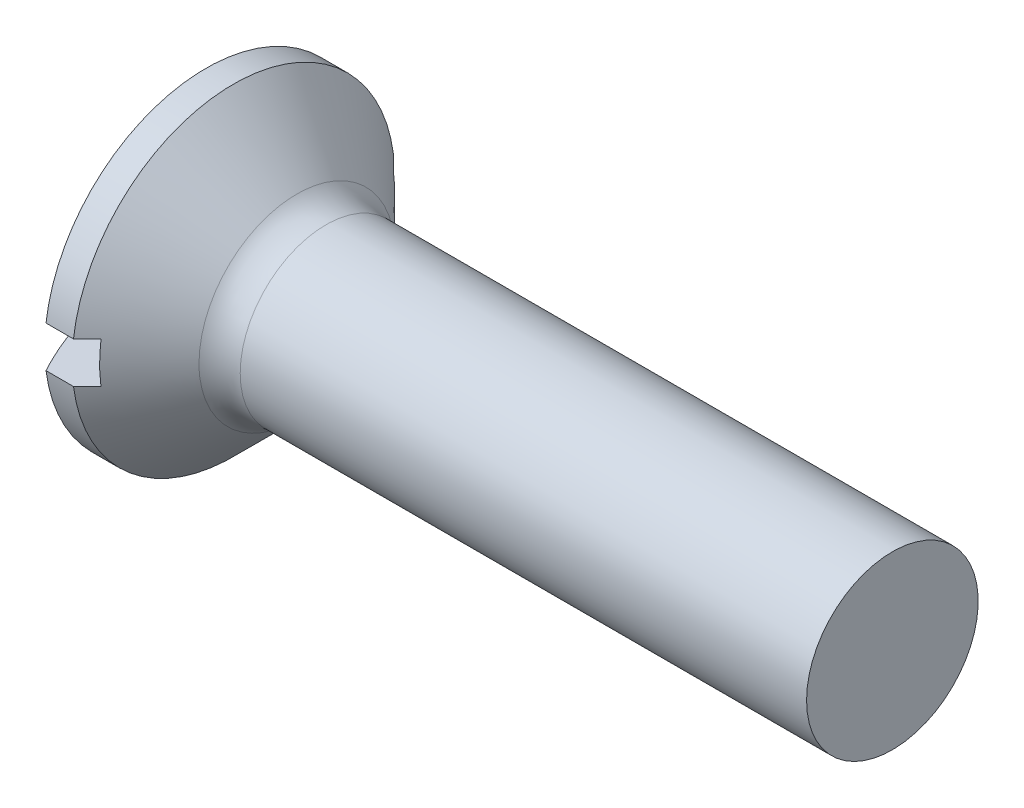
ISO-10303-21;
HEADER;
FILE_DESCRIPTION(('STEP AP214'),'2;1');
FILE_NAME('part.step','',(''),(''),'','','');
FILE_SCHEMA(('AUTOMOTIVE_DESIGN { 1 0 10303 214 1 1 1 1 }'));
ENDSEC;
DATA;
#1=APPLICATION_CONTEXT('core data for automotive mechanical design processes');
#2=APPLICATION_PROTOCOL_DEFINITION('international standard','automotive_design',2000,#1);
#3=PRODUCT_CONTEXT('',#1,'mechanical');
#4=PRODUCT('Part','Part','',(#3));
#5=PRODUCT_RELATED_PRODUCT_CATEGORY('part','',(#4));
#6=PRODUCT_DEFINITION_FORMATION('','',#4);
#7=PRODUCT_DEFINITION_CONTEXT('part definition',#1,'design');
#8=PRODUCT_DEFINITION('design','',#6,#7);
#9=PRODUCT_DEFINITION_SHAPE('','',#8);
#10=(LENGTH_UNIT() NAMED_UNIT(*) SI_UNIT(.MILLI.,.METRE.));
#11=(NAMED_UNIT(*) PLANE_ANGLE_UNIT() SI_UNIT($,.RADIAN.));
#12=(NAMED_UNIT(*) SI_UNIT($,.STERADIAN.) SOLID_ANGLE_UNIT());
#13=UNCERTAINTY_MEASURE_WITH_UNIT(LENGTH_MEASURE(1.E-05),#10,'distance_accuracy_value','');
#14=(GEOMETRIC_REPRESENTATION_CONTEXT(3) GLOBAL_UNCERTAINTY_ASSIGNED_CONTEXT((#13)) GLOBAL_UNIT_ASSIGNED_CONTEXT((#10,
#11,#12)) REPRESENTATION_CONTEXT('',''));
#15=CARTESIAN_POINT('',(0.,0.,0.));
#16=DIRECTION('',(0.,0.,1.));
#17=DIRECTION('',(1.,0.,0.));
#18=AXIS2_PLACEMENT_3D('',#15,#16,#17);
#19=CARTESIAN_POINT('',(4.90208333333334,0.,0.));
#20=DIRECTION('',(-1.,0.,0.));
#21=DIRECTION('',(0.,-1.,0.));
#22=AXIS2_PLACEMENT_3D('',#19,#20,#21);
#23=SPHERICAL_SURFACE('',#22,4.90208333333334);
#24=CARTESIAN_POINT('',(4.90208333333334,0.3,0.));
#25=DIRECTION('',(0.,1.,0.));
#26=DIRECTION('',(0.,0.,1.));
#27=AXIS2_PLACEMENT_3D('',#24,#25,#26);
#28=CIRCLE('',#27,4.89289495155419);
#29=CARTESIAN_POINT('',(0.6,0.3,2.33077240416133));
#30=VERTEX_POINT('',#29);
#31=CARTESIAN_POINT('',(0.6,0.3,-2.33077240416133));
#32=VERTEX_POINT('',#31);
#33=EDGE_CURVE('E184',#30,#32,#28,.F.);
#34=ORIENTED_EDGE('',*,*,#33,.F.);
#35=CARTESIAN_POINT('',(0.6,0.,0.));
#36=DIRECTION('',(-1.,0.,0.));
#37=DIRECTION('',(0.,0.,1.));
#38=AXIS2_PLACEMENT_3D('',#35,#36,#37);
#39=CIRCLE('',#38,2.35);
#40=EDGE_CURVE('E118',#30,#32,#39,.T.);
#41=ORIENTED_EDGE('',*,*,#40,.T.);
#42=EDGE_LOOP('',(#34,#41));
#43=FACE_BOUND('',#42,.T.);
#44=ADVANCED_FACE('F38',(#43),#23,.T.);
#45=CARTESIAN_POINT('',(-15.875,0.,0.));
#46=DIRECTION('',(-1.,0.,0.));
#47=DIRECTION('',(0.,0.,1.));
#48=AXIS2_PLACEMENT_3D('',#45,#46,#47);
#49=CYLINDRICAL_SURFACE('',#48,2.35);
#50=CARTESIAN_POINT('',(1.,0.,0.));
#51=DIRECTION('',(-1.,0.,0.));
#52=DIRECTION('',(0.,0.,1.));
#53=AXIS2_PLACEMENT_3D('',#50,#51,#52);
#54=CIRCLE('',#53,2.35);
#55=CARTESIAN_POINT('',(1.,0.3,2.33077240416133));
#56=VERTEX_POINT('',#55);
#57=CARTESIAN_POINT('',(1.,0.3,-2.33077240416133));
#58=VERTEX_POINT('',#57);
#59=EDGE_CURVE('E112',#56,#58,#54,.T.);
#60=ORIENTED_EDGE('',*,*,#59,.T.);
#61=DIRECTION('',(-1.,0.,0.));
#62=VECTOR('',#61,1.);
#63=CARTESIAN_POINT('',(-15.875,0.3,-2.33077240416133));
#64=LINE('',#63,#62);
#65=EDGE_CURVE('E66',#58,#32,#64,.T.);
#66=ORIENTED_EDGE('',*,*,#65,.T.);
#67=ORIENTED_EDGE('',*,*,#40,.F.);
#68=DIRECTION('',(-1.,0.,0.));
#69=VECTOR('',#68,1.);
#70=CARTESIAN_POINT('',(-15.875,0.3,2.33077240416133));
#71=LINE('',#70,#69);
#72=EDGE_CURVE('E182',#30,#56,#71,.F.);
#73=ORIENTED_EDGE('',*,*,#72,.T.);
#74=EDGE_LOOP('',(#60,#66,#67,#73));
#75=FACE_BOUND('',#74,.T.);
#76=ADVANCED_FACE('F156',(#75),#49,.T.);
#77=CARTESIAN_POINT('',(10.6,0.,0.));
#78=DIRECTION('',(-1.,0.,0.));
#79=DIRECTION('',(0.,0.,1.));
#80=AXIS2_PLACEMENT_3D('',#77,#78,#79);
#81=PLANE('',#80);
#82=CARTESIAN_POINT('',(10.6,0.,0.));
#83=DIRECTION('',(-1.,0.,0.));
#84=DIRECTION('',(0.,0.,1.));
#85=AXIS2_PLACEMENT_3D('',#82,#83,#84);
#86=CIRCLE('',#85,1.25);
#87=CARTESIAN_POINT('',(10.6,0.,1.25));
#88=VERTEX_POINT('',#87);
#89=EDGE_CURVE('E121',#88,#88,#86,.T.);
#90=ORIENTED_EDGE('',*,*,#89,.F.);
#91=EDGE_LOOP('',(#90));
#92=FACE_BOUND('',#91,.T.);
#93=ADVANCED_FACE('F163',(#92),#81,.F.);
#94=CARTESIAN_POINT('',(4.90208333333334,-0.3,0.));
#95=DIRECTION('',(0.,-1.,0.));
#96=DIRECTION('',(0.,0.,-1.));
#97=AXIS2_PLACEMENT_3D('',#94,#95,#96);
#98=CIRCLE('',#97,4.89289495155419);
#99=CARTESIAN_POINT('',(0.6,-0.299999999999999,-2.33077240416133));
#100=VERTEX_POINT('',#99);
#101=CARTESIAN_POINT('',(0.6,-0.3,2.33077240416133));
#102=VERTEX_POINT('',#101);
#103=EDGE_CURVE('E174',#100,#102,#98,.F.);
#104=ORIENTED_EDGE('',*,*,#103,.F.);
#105=EDGE_CURVE('E114',#100,#102,#39,.T.);
#106=ORIENTED_EDGE('',*,*,#105,.T.);
#107=EDGE_LOOP('',(#104,#106));
#108=FACE_BOUND('',#107,.T.);
#109=ADVANCED_FACE('F159',(#108),#23,.T.);
#110=CARTESIAN_POINT('',(1.,-0.299999999999999,-2.33077240416133));
#111=VERTEX_POINT('',#110);
#112=CARTESIAN_POINT('',(1.,-0.3,2.33077240416133));
#113=VERTEX_POINT('',#112);
#114=EDGE_CURVE('E115',#111,#113,#54,.T.);
#115=ORIENTED_EDGE('',*,*,#114,.T.);
#116=DIRECTION('',(-1.,0.,0.));
#117=VECTOR('',#116,1.);
#118=CARTESIAN_POINT('',(-15.875,-0.3,2.33077240416133));
#119=LINE('',#118,#117);
#120=EDGE_CURVE('E177',#113,#102,#119,.T.);
#121=ORIENTED_EDGE('',*,*,#120,.T.);
#122=ORIENTED_EDGE('',*,*,#105,.F.);
#123=DIRECTION('',(-1.,0.,0.));
#124=VECTOR('',#123,1.);
#125=CARTESIAN_POINT('',(-15.875,-0.299999999999999,-2.33077240416133));
#126=LINE('',#125,#124);
#127=EDGE_CURVE('E178',#100,#111,#126,.F.);
#128=ORIENTED_EDGE('',*,*,#127,.T.);
#129=EDGE_LOOP('',(#115,#121,#122,#128));
#130=FACE_BOUND('',#129,.T.);
#131=ADVANCED_FACE('F153',(#130),#49,.T.);
#132=CARTESIAN_POINT('',(1.,0.,0.));
#133=DIRECTION('',(-1.,0.,0.));
#134=DIRECTION('',(0.,0.,1.));
#135=AXIS2_PLACEMENT_3D('',#132,#133,#134);
#136=CONICAL_SURFACE('',#135,2.35,0.785398163397449);
#137=CARTESIAN_POINT('',(-1.82275203672138,0.3,-5.16404527801656));
#138=CARTESIAN_POINT('',(-1.64754958730794,0.3,-4.98854511223448));
#139=CARTESIAN_POINT('',(-1.47236000416515,0.3,-4.81303209254199));
#140=CARTESIAN_POINT('',(-1.12202075460717,0.3,-4.46196190687904));
#141=CARTESIAN_POINT('',(-0.94687108871008,0.3,-4.28640474039159));
#142=CARTESIAN_POINT('',(-0.596582016902504,0.3,-3.93518385937772));
#143=CARTESIAN_POINT('',(-0.421442627058235,0.3,-3.75952012882719));
#144=CARTESIAN_POINT('',(-0.0712537914550258,0.3,-3.40810721702208));
#145=CARTESIAN_POINT('',(0.103795655359153,0.3,-3.23235803681939));
#146=CARTESIAN_POINT('',(0.460088144205839,0.3,-2.87435321817226));
#147=CARTESIAN_POINT('',(0.64132596841188,0.3,-2.6920923874888));
#148=CARTESIAN_POINT('',(1.00354514464606,0.3,-2.32730280190244));
#149=CARTESIAN_POINT('',(1.18452648731344,0.3,-2.14477403769181));
#150=CARTESIAN_POINT('',(1.45556256140296,0.3,-1.87058192238541));
#151=CARTESIAN_POINT('',(1.54582728663923,0.3,-1.77912617438865));
#152=CARTESIAN_POINT('',(1.72613580420795,0.3,-1.59599412728003));
#153=CARTESIAN_POINT('',(1.8161795933095,0.3,-1.50431782498121));
#154=CARTESIAN_POINT('',(1.99588406923986,0.3,-1.32060275611908));
#155=CARTESIAN_POINT('',(2.08554478108396,0.3,-1.22856401400164));
#156=CARTESIAN_POINT('',(2.26418532619347,0.3,-1.04382868301959));
#157=CARTESIAN_POINT('',(2.35316518136162,0.3,-0.951132115503261));
#158=CARTESIAN_POINT('',(2.46505917883394,0.3,-0.832576740840201));
#159=CARTESIAN_POINT('',(2.48870474420126,0.3,-0.807409320196103));
#160=CARTESIAN_POINT('',(2.53583984019124,0.3,-0.756927871802545));
#161=CARTESIAN_POINT('',(2.55932936834119,0.3,-0.731613841741602));
#162=CARTESIAN_POINT('',(2.60601885231769,0.3,-0.680886100047077));
#163=CARTESIAN_POINT('',(2.62921954128008,0.3,-0.655473063997356));
#164=CARTESIAN_POINT('',(2.675337766447,0.3,-0.604392130207134));
#165=CARTESIAN_POINT('',(2.69825531271275,0.3,-0.578724241581383));
#166=CARTESIAN_POINT('',(2.7513958843352,0.3,-0.51826731406406));
#167=CARTESIAN_POINT('',(2.78145962199572,0.3,-0.483338135350433));
#168=CARTESIAN_POINT('',(2.8405689932522,0.3,-0.412218933886534));
#169=CARTESIAN_POINT('',(2.86960673903091,0.3,-0.376022191437645));
#170=CARTESIAN_POINT('',(2.9114850873813,0.3,-0.320072853564384));
#171=CARTESIAN_POINT('',(2.92524917786357,0.3,-0.301017234201491));
#172=CARTESIAN_POINT('',(2.95181957465597,0.3,-0.262201945071994));
#173=CARTESIAN_POINT('',(2.96462456529744,0.3,-0.242441361156985));
#174=CARTESIAN_POINT('',(2.98858863040398,0.3,-0.202182687483552));
#175=CARTESIAN_POINT('',(2.99976230181752,0.3,-0.181693479987382));
#176=CARTESIAN_POINT('',(3.01963945302138,0.3,-0.139575845156781));
#177=CARTESIAN_POINT('',(3.02835070556884,0.3,-0.117951263901652));
#178=CARTESIAN_POINT('',(3.04128209755064,0.3,-0.0753539742139996));
#179=CARTESIAN_POINT('',(3.04582445681639,0.3,-0.0544855635375963));
#180=CARTESIAN_POINT('',(3.05046691822308,0.3,-0.0123288497489134));
#181=CARTESIAN_POINT('',(3.05059046656826,0.3,0.00895663738570289));
#182=CARTESIAN_POINT('',(3.0464261956788,0.3,0.0509505716715626));
#183=CARTESIAN_POINT('',(3.04215902203701,0.3,0.0716612534321086));
#184=CARTESIAN_POINT('',(3.03030119680603,0.3,0.112203509888116));
#185=CARTESIAN_POINT('',(3.02268680351524,0.3,0.132027669143875));
#186=CARTESIAN_POINT('',(3.00622685916693,0.3,0.168572292117351));
#187=CARTESIAN_POINT('',(2.99760294736928,0.3,0.185396783307412));
#188=CARTESIAN_POINT('',(2.97917654074856,0.3,0.218395128215779));
#189=CARTESIAN_POINT('',(2.96937306670495,0.3,0.23456842627038));
#190=CARTESIAN_POINT('',(2.93871149333945,0.3,0.28243197683215));
#191=CARTESIAN_POINT('',(2.91666176421179,0.3,0.313348905503022));
#192=CARTESIAN_POINT('',(2.87076835420826,0.3,0.374243746859669));
#193=CARTESIAN_POINT('',(2.8469094719127,0.3,0.404209782728291));
#194=CARTESIAN_POINT('',(2.79830711124635,0.3,0.463297029753784));
#195=CARTESIAN_POINT('',(2.77356580894545,0.3,0.492420036344017));
#196=CARTESIAN_POINT('',(2.6995553977296,0.3,0.577829838417174));
#197=CARTESIAN_POINT('',(2.64948866646878,0.3,0.633419833726512));
#198=CARTESIAN_POINT('',(2.54836373861698,0.3,0.7436957712889));
#199=CARTESIAN_POINT('',(2.49730537025496,0.3,0.79838155382186));
#200=CARTESIAN_POINT('',(2.39456857586971,0.3,0.907291284144832));
#201=CARTESIAN_POINT('',(2.34288948055459,0.3,0.96151460047886));
#202=CARTESIAN_POINT('',(2.23919742314652,0.3,1.06963184533802));
#203=CARTESIAN_POINT('',(2.18718448744236,0.3,1.12352579925624));
#204=CARTESIAN_POINT('',(2.0318816012677,0.3,1.28379950959911));
#205=CARTESIAN_POINT('',(1.92827632250229,0.3,1.38987351167513));
#206=CARTESIAN_POINT('',(1.72070460330653,0.3,1.60156717940246));
#207=CARTESIAN_POINT('',(1.61673835836866,0.3,1.7071870373648));
#208=CARTESIAN_POINT('',(1.37557159980157,0.3,1.95163773521738));
#209=CARTESIAN_POINT('',(1.23828371519814,0.3,2.0903823802166));
#210=CARTESIAN_POINT('',(0.963486137442309,0.3,2.36765244003563));
#211=CARTESIAN_POINT('',(0.825976443595042,0.3,2.50617785416596));
#212=CARTESIAN_POINT('',(0.413192953066906,0.3,2.92161530315849));
#213=CARTESIAN_POINT('',(0.137721644880257,0.3,3.19833106315822));
#214=CARTESIAN_POINT('',(-0.418538177485844,0.3,3.75665266927046));
#215=CARTESIAN_POINT('',(-0.699330857482734,0.3,4.03825436110322));
#216=CARTESIAN_POINT('',(-1.26099255192529,0.3,4.60125960589025));
#217=CARTESIAN_POINT('',(-1.54186153654612,0.3,4.88266318859486));
#218=CARTESIAN_POINT('',(-1.82275203672138,0.3,5.16404527801656));
#219=B_SPLINE_CURVE_WITH_KNOTS('',3,(#137,#138,#139,#140,#141,#142,#143,#144,#145,#146,#147,
#148,#149,#150,#151,#152,#153,#154,#155,#156,#157,#158,#159,#160,#161,#162,#163,#164,#165,#166,
#167,#168,#169,#170,#171,#172,#173,#174,#175,#176,#177,#178,#179,#180,#181,#182,#183,#184,#185,
#186,#187,#188,#189,#190,#191,#192,#193,#194,#195,#196,#197,#198,#199,#200,#201,#202,#203,#204,
#205,#206,#207,#208,#209,#210,#211,#212,#213,#214,#215,#216,#217,#218),.UNSPECIFIED.,.F.,.F.,(4,
2,2,2,2,2,2,2,2,2,2,2,2,2,2,2,2,2,2,2,2,2,2,2,2,2,2,2,2,2,2,2,2,2,2,2,2,2,2,2,4),(0.,
0.743952870352577,1.48791490152672,2.23208151542587,2.97623918951494,3.74733929563187,
4.51846685478593,4.9039623477983,5.28946344501002,5.6749389716538,6.06040204521683,
6.16399983462291,6.26759926185074,6.37082991302826,6.47405688538717,6.61230458709904,
6.75145089376192,6.82195212826494,6.89254836759327,6.9624680798405,7.03216455728612,
7.09585752678058,7.15921249105328,7.22227090958055,7.28578400348509,7.34244077690176,
7.39914491306139,7.51294472887577,7.62783798502718,7.74246522116449,7.96687196692452,
8.19131793729752,8.41603267760232,8.64072986863151,9.08555454863182,9.53016739044921,
10.115728328683,10.7012911048979,11.8726592944065,13.0656791429272,14.2584398773778),.UNSPECIFIED.);
#220=CARTESIAN_POINT('',(1.2,0.3,2.12896688560438));
#221=VERTEX_POINT('',#220);
#222=EDGE_CURVE('E11',#221,#56,#219,.T.);
#223=ORIENTED_EDGE('',*,*,#222,.F.);
#224=CARTESIAN_POINT('',(1.2,0.,0.));
#225=DIRECTION('',(1.,0.,0.));
#226=DIRECTION('',(0.,0.,-1.));
#227=AXIS2_PLACEMENT_3D('',#224,#225,#226);
#228=CIRCLE('',#227,2.15);
#229=CARTESIAN_POINT('',(1.2,-0.3,2.12896688560438));
#230=VERTEX_POINT('',#229);
#231=EDGE_CURVE('E95',#230,#221,#228,.F.);
#232=ORIENTED_EDGE('',*,*,#231,.F.);
#233=CARTESIAN_POINT('',(-1.82275203672138,-0.3,5.16404527801656));
#234=CARTESIAN_POINT('',(-1.64754958730794,-0.3,4.98854511223448));
#235=CARTESIAN_POINT('',(-1.47236000416515,-0.3,4.81303209254199));
#236=CARTESIAN_POINT('',(-1.12202075460718,-0.3,4.46196190687904));
#237=CARTESIAN_POINT('',(-0.94687108871008,-0.3,4.28640474039159));
#238=CARTESIAN_POINT('',(-0.596582016902505,-0.3,3.93518385937772));
#239=CARTESIAN_POINT('',(-0.421442627058235,-0.3,3.75952012882719));
#240=CARTESIAN_POINT('',(-0.0712537914550263,-0.3,3.40810721702208));
#241=CARTESIAN_POINT('',(0.103795655359153,-0.3,3.23235803681939));
#242=CARTESIAN_POINT('',(0.460088144205839,-0.3,2.87435321817226));
#243=CARTESIAN_POINT('',(0.641325968411881,-0.3,2.6920923874888));
#244=CARTESIAN_POINT('',(1.00354514464606,-0.3,2.32730280190244));
#245=CARTESIAN_POINT('',(1.18452648731344,-0.3,2.14477403769181));
#246=CARTESIAN_POINT('',(1.45556256140296,-0.3,1.87058192238541));
#247=CARTESIAN_POINT('',(1.54582728663923,-0.3,1.77912617438865));
#248=CARTESIAN_POINT('',(1.72613580420796,-0.3,1.59599412728003));
#249=CARTESIAN_POINT('',(1.8161795933095,-0.3,1.50431782498121));
#250=CARTESIAN_POINT('',(1.99588406923986,-0.3,1.32060275611908));
#251=CARTESIAN_POINT('',(2.08554478108396,-0.3,1.22856401400164));
#252=CARTESIAN_POINT('',(2.26418532619348,-0.3,1.04382868301958));
#253=CARTESIAN_POINT('',(2.35316518136162,-0.3,0.95113211550326));
#254=CARTESIAN_POINT('',(2.46505917883394,-0.3,0.832576740840201));
#255=CARTESIAN_POINT('',(2.48870474420126,-0.3,0.807409320196102));
#256=CARTESIAN_POINT('',(2.53583984019124,-0.3,0.756927871802545));
#257=CARTESIAN_POINT('',(2.55932936834119,-0.3,0.731613841741602));
#258=CARTESIAN_POINT('',(2.60601885231769,-0.3,0.680886100047076));
#259=CARTESIAN_POINT('',(2.62921954128008,-0.3,0.655473063997356));
#260=CARTESIAN_POINT('',(2.675337766447,-0.3,0.604392130207134));
#261=CARTESIAN_POINT('',(2.69825531271275,-0.3,0.578724241581382));
#262=CARTESIAN_POINT('',(2.7513958843352,-0.3,0.518267314064059));
#263=CARTESIAN_POINT('',(2.78145962199572,-0.3,0.483338135350433));
#264=CARTESIAN_POINT('',(2.8405689932522,-0.3,0.412218933886534));
#265=CARTESIAN_POINT('',(2.86960673903091,-0.3,0.376022191437645));
#266=CARTESIAN_POINT('',(2.9114850873813,-0.3,0.320072853564383));
#267=CARTESIAN_POINT('',(2.92524917786357,-0.3,0.301017234201491));
#268=CARTESIAN_POINT('',(2.95181957465597,-0.3,0.262201945071994));
#269=CARTESIAN_POINT('',(2.96462456529745,-0.3,0.242441361156985));
#270=CARTESIAN_POINT('',(2.98858863040398,-0.3,0.202182687483552));
#271=CARTESIAN_POINT('',(2.99976230181752,-0.3,0.181693479987382));
#272=CARTESIAN_POINT('',(3.01963945302138,-0.3,0.13957584515678));
#273=CARTESIAN_POINT('',(3.02835070556884,-0.3,0.117951263901652));
#274=CARTESIAN_POINT('',(3.04128209755064,-0.3,0.0753539742139996));
#275=CARTESIAN_POINT('',(3.04582445681639,-0.3,0.0544855635375964));
#276=CARTESIAN_POINT('',(3.05046691822308,-0.3,0.0123288497489135));
#277=CARTESIAN_POINT('',(3.05059046656826,-0.3,-0.00895663738570284));
#278=CARTESIAN_POINT('',(3.0464261956788,-0.3,-0.0509505716715626));
#279=CARTESIAN_POINT('',(3.04215902203701,-0.3,-0.0716612534321086));
#280=CARTESIAN_POINT('',(3.03030119680603,-0.3,-0.112203509888116));
#281=CARTESIAN_POINT('',(3.02268680351524,-0.3,-0.132027669143875));
#282=CARTESIAN_POINT('',(3.00622685916693,-0.3,-0.168572292117351));
#283=CARTESIAN_POINT('',(2.99760294736928,-0.3,-0.185396783307412));
#284=CARTESIAN_POINT('',(2.97917654074856,-0.3,-0.218395128215779));
#285=CARTESIAN_POINT('',(2.96937306670495,-0.3,-0.234568426270379));
#286=CARTESIAN_POINT('',(2.93871149333945,-0.3,-0.282431976832149));
#287=CARTESIAN_POINT('',(2.91666176421179,-0.3,-0.313348905503022));
#288=CARTESIAN_POINT('',(2.87076835420826,-0.3,-0.374243746859668));
#289=CARTESIAN_POINT('',(2.8469094719127,-0.3,-0.404209782728291));
#290=CARTESIAN_POINT('',(2.79830711124635,-0.3,-0.463297029753784));
#291=CARTESIAN_POINT('',(2.77356580894545,-0.3,-0.492420036344017));
#292=CARTESIAN_POINT('',(2.6995553977296,-0.3,-0.577829838417173));
#293=CARTESIAN_POINT('',(2.64948866646879,-0.3,-0.633419833726511));
#294=CARTESIAN_POINT('',(2.54836373861698,-0.3,-0.743695771288899));
#295=CARTESIAN_POINT('',(2.49730537025496,-0.3,-0.798381553821859));
#296=CARTESIAN_POINT('',(2.39456857586971,-0.3,-0.907291284144831));
#297=CARTESIAN_POINT('',(2.34288948055459,-0.3,-0.961514600478859));
#298=CARTESIAN_POINT('',(2.23919742314653,-0.3,-1.06963184533802));
#299=CARTESIAN_POINT('',(2.18718448744236,-0.299999999999999,-1.12352579925624));
#300=CARTESIAN_POINT('',(2.0318816012677,-0.299999999999999,-1.28379950959911));
#301=CARTESIAN_POINT('',(1.9282763225023,-0.299999999999999,-1.38987351167513));
#302=CARTESIAN_POINT('',(1.72070460330653,-0.299999999999999,-1.60156717940246));
#303=CARTESIAN_POINT('',(1.61673835836866,-0.299999999999999,-1.7071870373648));
#304=CARTESIAN_POINT('',(1.37557159980157,-0.299999999999999,-1.95163773521738));
#305=CARTESIAN_POINT('',(1.23828371519814,-0.299999999999999,-2.0903823802166));
#306=CARTESIAN_POINT('',(0.963486137442309,-0.299999999999999,-2.36765244003563));
#307=CARTESIAN_POINT('',(0.825976443595042,-0.299999999999999,-2.50617785416596));
#308=CARTESIAN_POINT('',(0.413192953066907,-0.299999999999999,-2.92161530315849));
#309=CARTESIAN_POINT('',(0.137721644880258,-0.299999999999999,-3.19833106315821));
#310=CARTESIAN_POINT('',(-0.418538177485843,-0.299999999999999,-3.75665266927046));
#311=CARTESIAN_POINT('',(-0.699330857482733,-0.299999999999999,-4.03825436110322));
#312=CARTESIAN_POINT('',(-1.26099255192529,-0.299999999999999,-4.60125960589025));
#313=CARTESIAN_POINT('',(-1.54186153654612,-0.299999999999999,-4.88266318859487));
#314=CARTESIAN_POINT('',(-1.82275203672138,-0.299999999999999,-5.16404527801657));
#315=B_SPLINE_CURVE_WITH_KNOTS('',3,(#233,#234,#235,#236,#237,#238,#239,#240,#241,#242,#243,
#244,#245,#246,#247,#248,#249,#250,#251,#252,#253,#254,#255,#256,#257,#258,#259,#260,#261,#262,
#263,#264,#265,#266,#267,#268,#269,#270,#271,#272,#273,#274,#275,#276,#277,#278,#279,#280,#281,
#282,#283,#284,#285,#286,#287,#288,#289,#290,#291,#292,#293,#294,#295,#296,#297,#298,#299,#300,
#301,#302,#303,#304,#305,#306,#307,#308,#309,#310,#311,#312,#313,#314),.UNSPECIFIED.,.F.,.F.,(4,
2,2,2,2,2,2,2,2,2,2,2,2,2,2,2,2,2,2,2,2,2,2,2,2,2,2,2,2,2,2,2,2,2,2,2,2,2,2,2,4),(0.,
0.743952870352577,1.48791490152672,2.23208151542587,2.97623918951494,3.74733929563187,
4.51846685478593,4.9039623477983,5.28946344501002,5.6749389716538,6.06040204521683,
6.16399983462291,6.26759926185074,6.37082991302826,6.47405688538717,6.61230458709904,
6.75145089376193,6.82195212826494,6.89254836759327,6.96246807984051,7.03216455728612,
7.09585752678058,7.15921249105328,7.22227090958055,7.28578400348509,7.34244077690176,
7.39914491306139,7.51294472887577,7.62783798502718,7.74246522116449,7.96687196692452,
8.19131793729751,8.41603267760232,8.64072986863151,9.08555454863182,9.53016739044921,
10.115728328683,10.7012911048979,11.8726592944065,13.0656791429272,14.2584398773778),.UNSPECIFIED.);
#316=EDGE_CURVE('E52',#113,#230,#315,.T.);
#317=ORIENTED_EDGE('',*,*,#316,.F.);
#318=ORIENTED_EDGE('',*,*,#114,.F.);
#319=CARTESIAN_POINT('',(1.2,-0.299999999999999,-2.12896688560438));
#320=VERTEX_POINT('',#319);
#321=EDGE_CURVE('E130',#320,#111,#315,.T.);
#322=ORIENTED_EDGE('',*,*,#321,.F.);
#323=CARTESIAN_POINT('',(1.2,0.3,-2.12896688560438));
#324=VERTEX_POINT('',#323);
#325=EDGE_CURVE('E103',#324,#320,#228,.F.);
#326=ORIENTED_EDGE('',*,*,#325,.F.);
#327=EDGE_CURVE('E42',#58,#324,#219,.T.);
#328=ORIENTED_EDGE('',*,*,#327,.F.);
#329=ORIENTED_EDGE('',*,*,#59,.F.);
#330=EDGE_LOOP('',(#223,#232,#317,#318,#322,#326,#328,#329));
#331=FACE_BOUND('',#330,.T.);
#332=CARTESIAN_POINT('',(1.92426406871193,0.,0.));
#333=DIRECTION('',(1.,0.,0.));
#334=DIRECTION('',(0.,0.,-1.));
#335=AXIS2_PLACEMENT_3D('',#332,#333,#334);
#336=CIRCLE('',#335,1.42573593128807);
#337=CARTESIAN_POINT('',(1.92426406871193,0.,-1.42573593128807));
#338=VERTEX_POINT('',#337);
#339=EDGE_CURVE('E125',#338,#338,#336,.F.);
#340=ORIENTED_EDGE('',*,*,#339,.T.);
#341=EDGE_LOOP('',(#340));
#342=FACE_BOUND('',#341,.T.);
#343=ADVANCED_FACE('F109',(#331,#342),#136,.T.);
#344=CARTESIAN_POINT('',(-15.875,0.,0.));
#345=DIRECTION('',(-1.,0.,0.));
#346=DIRECTION('',(0.,0.,1.));
#347=AXIS2_PLACEMENT_3D('',#344,#345,#346);
#348=CYLINDRICAL_SURFACE('',#347,1.25);
#349=CARTESIAN_POINT('',(2.34852813742386,0.,0.));
#350=DIRECTION('',(-1.,0.,0.));
#351=DIRECTION('',(0.,0.,1.));
#352=AXIS2_PLACEMENT_3D('',#349,#350,#351);
#353=CIRCLE('',#352,1.25);
#354=CARTESIAN_POINT('',(2.34852813742386,0.,1.25));
#355=VERTEX_POINT('',#354);
#356=EDGE_CURVE('E128',#355,#355,#353,.F.);
#357=ORIENTED_EDGE('',*,*,#356,.T.);
#358=EDGE_LOOP('',(#357));
#359=FACE_BOUND('',#358,.T.);
#360=ORIENTED_EDGE('',*,*,#89,.T.);
#361=EDGE_LOOP('',(#360));
#362=FACE_BOUND('',#361,.T.);
#363=ADVANCED_FACE('F145',(#359,#362),#348,.T.);
#364=CARTESIAN_POINT('',(2.34852813742386,0.,0.));
#365=DIRECTION('',(-1.,0.,0.));
#366=DIRECTION('',(0.,0.,1.));
#367=AXIS2_PLACEMENT_3D('',#364,#365,#366);
#368=TOROIDAL_SURFACE('',#367,1.85,0.6);
#369=ORIENTED_EDGE('',*,*,#356,.F.);
#370=EDGE_LOOP('',(#369));
#371=FACE_BOUND('',#370,.T.);
#372=ORIENTED_EDGE('',*,*,#339,.F.);
#373=EDGE_LOOP('',(#372));
#374=FACE_BOUND('',#373,.T.);
#375=ADVANCED_FACE('F40',(#371,#374),#368,.F.);
#376=CARTESIAN_POINT('',(1.2,0.3,2.35));
#377=DIRECTION('',(0.,1.,0.));
#378=DIRECTION('',(0.,0.,1.));
#379=AXIS2_PLACEMENT_3D('',#376,#377,#378);
#380=PLANE('',#379);
#381=ORIENTED_EDGE('',*,*,#327,.T.);
#382=DIRECTION('',(0.,0.,-1.));
#383=VECTOR('',#382,1.);
#384=CARTESIAN_POINT('',(1.2,0.3,2.35));
#385=LINE('',#384,#383);
#386=EDGE_CURVE('E59',#221,#324,#385,.T.);
#387=ORIENTED_EDGE('',*,*,#386,.F.);
#388=ORIENTED_EDGE('',*,*,#222,.T.);
#389=ORIENTED_EDGE('',*,*,#72,.F.);
#390=ORIENTED_EDGE('',*,*,#33,.T.);
#391=ORIENTED_EDGE('',*,*,#65,.F.);
#392=EDGE_LOOP('',(#381,#387,#388,#389,#390,#391));
#393=FACE_BOUND('',#392,.T.);
#394=ADVANCED_FACE('F104',(#393),#380,.F.);
#395=CARTESIAN_POINT('',(1.2,-0.299999999999999,-2.35));
#396=DIRECTION('',(0.,-1.,0.));
#397=DIRECTION('',(0.,0.,-1.));
#398=AXIS2_PLACEMENT_3D('',#395,#396,#397);
#399=PLANE('',#398);
#400=ORIENTED_EDGE('',*,*,#316,.T.);
#401=DIRECTION('',(0.,0.,1.));
#402=VECTOR('',#401,1.);
#403=CARTESIAN_POINT('',(1.2,-0.299999999999999,-2.35));
#404=LINE('',#403,#402);
#405=EDGE_CURVE('E98',#320,#230,#404,.T.);
#406=ORIENTED_EDGE('',*,*,#405,.F.);
#407=ORIENTED_EDGE('',*,*,#321,.T.);
#408=ORIENTED_EDGE('',*,*,#127,.F.);
#409=ORIENTED_EDGE('',*,*,#103,.T.);
#410=ORIENTED_EDGE('',*,*,#120,.F.);
#411=EDGE_LOOP('',(#400,#406,#407,#408,#409,#410));
#412=FACE_BOUND('',#411,.T.);
#413=ADVANCED_FACE('F138',(#412),#399,.F.);
#414=CARTESIAN_POINT('',(1.2,-0.299999999999999,-2.35));
#415=DIRECTION('',(1.,0.,0.));
#416=DIRECTION('',(0.,0.,-1.));
#417=AXIS2_PLACEMENT_3D('',#414,#415,#416);
#418=PLANE('',#417);
#419=ORIENTED_EDGE('',*,*,#231,.T.);
#420=ORIENTED_EDGE('',*,*,#386,.T.);
#421=ORIENTED_EDGE('',*,*,#325,.T.);
#422=ORIENTED_EDGE('',*,*,#405,.T.);
#423=EDGE_LOOP('',(#419,#420,#421,#422));
#424=FACE_BOUND('',#423,.T.);
#425=ADVANCED_FACE('F96',(#424),#418,.F.);
#426=CLOSED_SHELL('',(#44,#76,#93,#109,#131,#343,#363,#375,#394,#413,#425));
#427=MANIFOLD_SOLID_BREP('B2',#426);
#428=ADVANCED_BREP_SHAPE_REPRESENTATION('',(#18,#427),#14);
#429=SHAPE_DEFINITION_REPRESENTATION(#9,#428);
ENDSEC;
END-ISO-10303-21;
